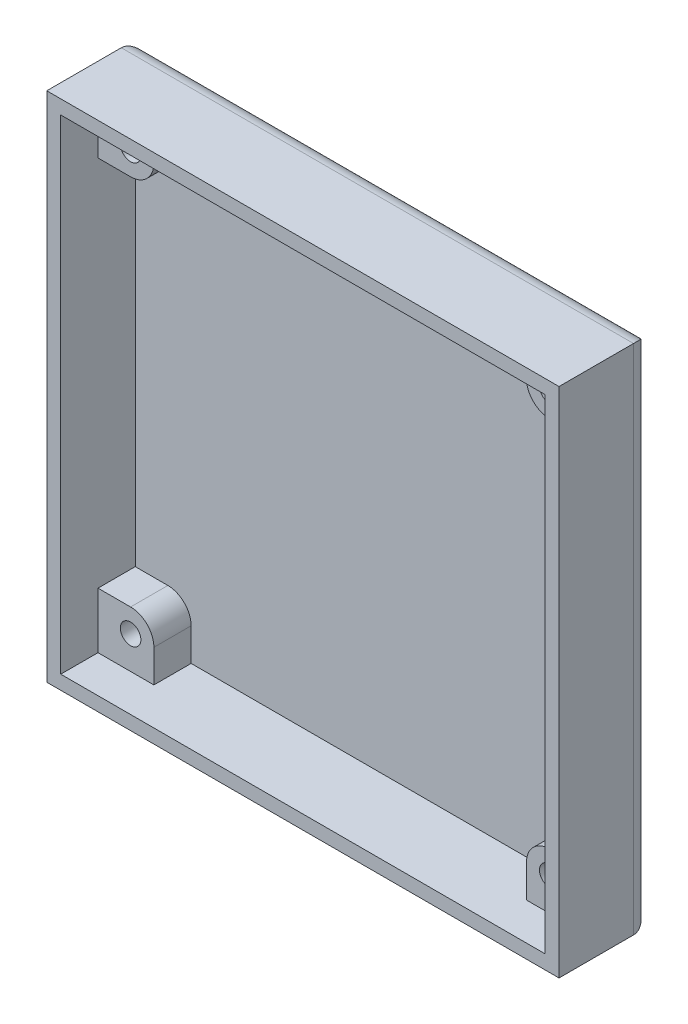
ISO-10303-21;
HEADER;
FILE_DESCRIPTION(('STEP AP214'),'2;1');
FILE_NAME('part.step','',(''),(''),'','','');
FILE_SCHEMA(('AUTOMOTIVE_DESIGN { 1 0 10303 214 1 1 1 1 }'));
ENDSEC;
DATA;
#1=APPLICATION_CONTEXT('core data for automotive mechanical design processes');
#2=APPLICATION_PROTOCOL_DEFINITION('international standard','automotive_design',2000,#1);
#3=PRODUCT_CONTEXT('',#1,'mechanical');
#4=PRODUCT('Part','Part','',(#3));
#5=PRODUCT_RELATED_PRODUCT_CATEGORY('part','',(#4));
#6=PRODUCT_DEFINITION_FORMATION('','',#4);
#7=PRODUCT_DEFINITION_CONTEXT('part definition',#1,'design');
#8=PRODUCT_DEFINITION('design','',#6,#7);
#9=PRODUCT_DEFINITION_SHAPE('','',#8);
#10=(LENGTH_UNIT() NAMED_UNIT(*) SI_UNIT(.MILLI.,.METRE.));
#11=(NAMED_UNIT(*) PLANE_ANGLE_UNIT() SI_UNIT($,.RADIAN.));
#12=(NAMED_UNIT(*) SI_UNIT($,.STERADIAN.) SOLID_ANGLE_UNIT());
#13=UNCERTAINTY_MEASURE_WITH_UNIT(LENGTH_MEASURE(1.E-05),#10,'distance_accuracy_value','');
#14=(GEOMETRIC_REPRESENTATION_CONTEXT(3) GLOBAL_UNCERTAINTY_ASSIGNED_CONTEXT((#13)) GLOBAL_UNIT_ASSIGNED_CONTEXT((#10,
#11,#12)) REPRESENTATION_CONTEXT('',''));
#15=CARTESIAN_POINT('',(0.,0.,0.));
#16=DIRECTION('',(0.,0.,1.));
#17=DIRECTION('',(1.,0.,0.));
#18=AXIS2_PLACEMENT_3D('',#15,#16,#17);
#19=CARTESIAN_POINT('',(22.5,-22.5,6.));
#20=DIRECTION('',(0.,0.,-1.));
#21=DIRECTION('',(-1.,0.,0.));
#22=AXIS2_PLACEMENT_3D('',#19,#20,#21);
#23=CYLINDRICAL_SURFACE('',#22,2.5);
#24=DIRECTION('',(0.,0.,-1.));
#25=VECTOR('',#24,1.);
#26=CARTESIAN_POINT('',(20.,-22.5,6.));
#27=LINE('',#26,#25);
#28=CARTESIAN_POINT('',(20.,-22.5,6.));
#29=VERTEX_POINT('',#28);
#30=CARTESIAN_POINT('',(20.,-22.5,2.));
#31=VERTEX_POINT('',#30);
#32=EDGE_CURVE('E242',#29,#31,#27,.T.);
#33=ORIENTED_EDGE('',*,*,#32,.F.);
#34=CARTESIAN_POINT('',(22.5,-22.5,6.));
#35=DIRECTION('',(0.,0.,1.));
#36=DIRECTION('',(1.,0.,0.));
#37=AXIS2_PLACEMENT_3D('',#34,#35,#36);
#38=CIRCLE('',#37,2.5);
#39=CARTESIAN_POINT('',(22.5,-20.,6.));
#40=VERTEX_POINT('',#39);
#41=EDGE_CURVE('E230',#40,#29,#38,.T.);
#42=ORIENTED_EDGE('',*,*,#41,.F.);
#43=DIRECTION('',(0.,0.,-1.));
#44=VECTOR('',#43,1.);
#45=CARTESIAN_POINT('',(22.5,-20.,6.));
#46=LINE('',#45,#44);
#47=CARTESIAN_POINT('',(22.5,-20.,2.));
#48=VERTEX_POINT('',#47);
#49=EDGE_CURVE('E247',#40,#48,#46,.T.);
#50=ORIENTED_EDGE('',*,*,#49,.T.);
#51=CARTESIAN_POINT('',(22.5,-22.5,2.));
#52=DIRECTION('',(0.,0.,-1.));
#53=DIRECTION('',(-1.,0.,0.));
#54=AXIS2_PLACEMENT_3D('',#51,#52,#53);
#55=CIRCLE('',#54,2.5);
#56=EDGE_CURVE('E11',#48,#31,#55,.F.);
#57=ORIENTED_EDGE('',*,*,#56,.T.);
#58=EDGE_LOOP('',(#33,#42,#50,#57));
#59=FACE_BOUND('',#58,.T.);
#60=ADVANCED_FACE('F39',(#59),#23,.T.);
#61=CARTESIAN_POINT('',(0.,0.,2.));
#62=DIRECTION('',(0.,0.,-1.));
#63=DIRECTION('',(-1.,0.,0.));
#64=AXIS2_PLACEMENT_3D('',#61,#62,#63);
#65=PLANE('',#64);
#66=DIRECTION('',(1.,0.,0.));
#67=VECTOR('',#66,1.);
#68=CARTESIAN_POINT('',(-26.,-26.,2.));
#69=LINE('',#68,#67);
#70=CARTESIAN_POINT('',(-20.,-26.,2.));
#71=VERTEX_POINT('',#70);
#72=CARTESIAN_POINT('',(20.,-26.,2.));
#73=VERTEX_POINT('',#72);
#74=EDGE_CURVE('E365',#71,#73,#69,.T.);
#75=ORIENTED_EDGE('',*,*,#74,.T.);
#76=DIRECTION('',(0.,1.,0.));
#77=VECTOR('',#76,1.);
#78=CARTESIAN_POINT('',(20.,0.,2.));
#79=LINE('',#78,#77);
#80=EDGE_CURVE('E218',#73,#31,#79,.T.);
#81=ORIENTED_EDGE('',*,*,#80,.T.);
#82=ORIENTED_EDGE('',*,*,#56,.F.);
#83=DIRECTION('',(1.,0.,0.));
#84=VECTOR('',#83,1.);
#85=CARTESIAN_POINT('',(0.,-20.,2.));
#86=LINE('',#85,#84);
#87=CARTESIAN_POINT('',(26.,-20.,2.));
#88=VERTEX_POINT('',#87);
#89=EDGE_CURVE('E231',#48,#88,#86,.T.);
#90=ORIENTED_EDGE('',*,*,#89,.T.);
#91=DIRECTION('',(0.,1.,0.));
#92=VECTOR('',#91,1.);
#93=CARTESIAN_POINT('',(26.,-26.,2.));
#94=LINE('',#93,#92);
#95=CARTESIAN_POINT('',(26.,20.,2.));
#96=VERTEX_POINT('',#95);
#97=EDGE_CURVE('E356',#88,#96,#94,.T.);
#98=ORIENTED_EDGE('',*,*,#97,.T.);
#99=DIRECTION('',(-1.,0.,0.));
#100=VECTOR('',#99,1.);
#101=CARTESIAN_POINT('',(0.,20.,2.));
#102=LINE('',#101,#100);
#103=CARTESIAN_POINT('',(22.5,20.,2.));
#104=VERTEX_POINT('',#103);
#105=EDGE_CURVE('E283',#96,#104,#102,.T.);
#106=ORIENTED_EDGE('',*,*,#105,.T.);
#107=CARTESIAN_POINT('',(22.5,22.5,2.));
#108=DIRECTION('',(0.,0.,-1.));
#109=DIRECTION('',(-1.,0.,0.));
#110=AXIS2_PLACEMENT_3D('',#107,#108,#109);
#111=CIRCLE('',#110,2.5);
#112=CARTESIAN_POINT('',(20.,22.5,2.));
#113=VERTEX_POINT('',#112);
#114=EDGE_CURVE('E435',#113,#104,#111,.F.);
#115=ORIENTED_EDGE('',*,*,#114,.F.);
#116=DIRECTION('',(0.,1.,0.));
#117=VECTOR('',#116,1.);
#118=CARTESIAN_POINT('',(20.,0.,2.));
#119=LINE('',#118,#117);
#120=CARTESIAN_POINT('',(20.,26.,2.));
#121=VERTEX_POINT('',#120);
#122=EDGE_CURVE('E287',#113,#121,#119,.T.);
#123=ORIENTED_EDGE('',*,*,#122,.T.);
#124=DIRECTION('',(-1.,0.,0.));
#125=VECTOR('',#124,1.);
#126=CARTESIAN_POINT('',(-26.,26.,2.));
#127=LINE('',#126,#125);
#128=CARTESIAN_POINT('',(-20.,26.,2.));
#129=VERTEX_POINT('',#128);
#130=EDGE_CURVE('E358',#121,#129,#127,.T.);
#131=ORIENTED_EDGE('',*,*,#130,.T.);
#132=DIRECTION('',(0.,1.,0.));
#133=VECTOR('',#132,1.);
#134=CARTESIAN_POINT('',(-20.,0.,2.));
#135=LINE('',#134,#133);
#136=CARTESIAN_POINT('',(-20.,22.5,2.));
#137=VERTEX_POINT('',#136);
#138=EDGE_CURVE('E271',#137,#129,#135,.T.);
#139=ORIENTED_EDGE('',*,*,#138,.F.);
#140=CARTESIAN_POINT('',(-22.5,22.5,2.));
#141=DIRECTION('',(0.,0.,-1.));
#142=DIRECTION('',(-1.,0.,0.));
#143=AXIS2_PLACEMENT_3D('',#140,#141,#142);
#144=CIRCLE('',#143,2.5);
#145=CARTESIAN_POINT('',(-22.5,20.,2.));
#146=VERTEX_POINT('',#145);
#147=EDGE_CURVE('E424',#146,#137,#144,.F.);
#148=ORIENTED_EDGE('',*,*,#147,.F.);
#149=DIRECTION('',(1.,0.,0.));
#150=VECTOR('',#149,1.);
#151=CARTESIAN_POINT('',(0.,20.,2.));
#152=LINE('',#151,#150);
#153=CARTESIAN_POINT('',(-26.,20.,2.));
#154=VERTEX_POINT('',#153);
#155=EDGE_CURVE('E308',#154,#146,#152,.T.);
#156=ORIENTED_EDGE('',*,*,#155,.F.);
#157=DIRECTION('',(0.,-1.,0.));
#158=VECTOR('',#157,1.);
#159=CARTESIAN_POINT('',(-26.,-26.,2.));
#160=LINE('',#159,#158);
#161=CARTESIAN_POINT('',(-26.,-20.,2.));
#162=VERTEX_POINT('',#161);
#163=EDGE_CURVE('E362',#154,#162,#160,.T.);
#164=ORIENTED_EDGE('',*,*,#163,.T.);
#165=DIRECTION('',(-1.,0.,0.));
#166=VECTOR('',#165,1.);
#167=CARTESIAN_POINT('',(0.,-20.,2.));
#168=LINE('',#167,#166);
#169=CARTESIAN_POINT('',(-22.5,-20.,2.));
#170=VERTEX_POINT('',#169);
#171=EDGE_CURVE('E255',#170,#162,#168,.T.);
#172=ORIENTED_EDGE('',*,*,#171,.F.);
#173=CARTESIAN_POINT('',(-22.5,-22.5,2.));
#174=DIRECTION('',(0.,0.,-1.));
#175=DIRECTION('',(-1.,0.,0.));
#176=AXIS2_PLACEMENT_3D('',#173,#174,#175);
#177=CIRCLE('',#176,2.5);
#178=CARTESIAN_POINT('',(-20.,-22.5,2.));
#179=VERTEX_POINT('',#178);
#180=EDGE_CURVE('E47',#179,#170,#177,.F.);
#181=ORIENTED_EDGE('',*,*,#180,.F.);
#182=DIRECTION('',(0.,1.,0.));
#183=VECTOR('',#182,1.);
#184=CARTESIAN_POINT('',(-20.,0.,2.));
#185=LINE('',#184,#183);
#186=EDGE_CURVE('E223',#71,#179,#185,.T.);
#187=ORIENTED_EDGE('',*,*,#186,.F.);
#188=EDGE_LOOP('',(#75,#81,#82,#90,#98,#106,#115,#123,#131,#139,#148,#156,#164,#172,#181,#187));
#189=FACE_BOUND('',#188,.T.);
#190=ADVANCED_FACE('F446',(#189),#65,.F.);
#191=CARTESIAN_POINT('',(-26.,-26.,2.));
#192=DIRECTION('',(-1.,0.,0.));
#193=DIRECTION('',(0.,0.,1.));
#194=AXIS2_PLACEMENT_3D('',#191,#192,#193);
#195=PLANE('',#194);
#196=DIRECTION('',(0.,0.,-1.));
#197=VECTOR('',#196,1.);
#198=CARTESIAN_POINT('',(-26.,-20.,6.));
#199=LINE('',#198,#197);
#200=CARTESIAN_POINT('',(-26.,-20.,6.));
#201=VERTEX_POINT('',#200);
#202=EDGE_CURVE('E261',#201,#162,#199,.T.);
#203=ORIENTED_EDGE('',*,*,#202,.T.);
#204=ORIENTED_EDGE('',*,*,#163,.F.);
#205=DIRECTION('',(0.,0.,-1.));
#206=VECTOR('',#205,1.);
#207=CARTESIAN_POINT('',(-26.,20.,6.));
#208=LINE('',#207,#206);
#209=CARTESIAN_POINT('',(-26.,20.,6.));
#210=VERTEX_POINT('',#209);
#211=EDGE_CURVE('E319',#210,#154,#208,.T.);
#212=ORIENTED_EDGE('',*,*,#211,.F.);
#213=DIRECTION('',(0.,-1.,0.));
#214=VECTOR('',#213,1.);
#215=CARTESIAN_POINT('',(-26.,0.,6.));
#216=LINE('',#215,#214);
#217=CARTESIAN_POINT('',(-26.,26.,6.));
#218=VERTEX_POINT('',#217);
#219=EDGE_CURVE('E309',#218,#210,#216,.T.);
#220=ORIENTED_EDGE('',*,*,#219,.F.);
#221=DIRECTION('',(0.,0.,1.));
#222=VECTOR('',#221,1.);
#223=CARTESIAN_POINT('',(-26.,26.,2.));
#224=LINE('',#223,#222);
#225=CARTESIAN_POINT('',(-26.,26.,10.));
#226=VERTEX_POINT('',#225);
#227=EDGE_CURVE('E383',#218,#226,#224,.T.);
#228=ORIENTED_EDGE('',*,*,#227,.T.);
#229=DIRECTION('',(0.,-1.,0.));
#230=VECTOR('',#229,1.);
#231=CARTESIAN_POINT('',(-26.,-26.,10.));
#232=LINE('',#231,#230);
#233=CARTESIAN_POINT('',(-26.,-26.,10.));
#234=VERTEX_POINT('',#233);
#235=EDGE_CURVE('E375',#226,#234,#232,.T.);
#236=ORIENTED_EDGE('',*,*,#235,.T.);
#237=DIRECTION('',(0.,0.,1.));
#238=VECTOR('',#237,1.);
#239=CARTESIAN_POINT('',(-26.,-26.,2.));
#240=LINE('',#239,#238);
#241=CARTESIAN_POINT('',(-26.,-26.,6.));
#242=VERTEX_POINT('',#241);
#243=EDGE_CURVE('E381',#242,#234,#240,.T.);
#244=ORIENTED_EDGE('',*,*,#243,.F.);
#245=DIRECTION('',(0.,-1.,0.));
#246=VECTOR('',#245,1.);
#247=CARTESIAN_POINT('',(-26.,0.,6.));
#248=LINE('',#247,#246);
#249=EDGE_CURVE('E259',#201,#242,#248,.T.);
#250=ORIENTED_EDGE('',*,*,#249,.F.);
#251=EDGE_LOOP('',(#203,#204,#212,#220,#228,#236,#244,#250));
#252=FACE_BOUND('',#251,.T.);
#253=ADVANCED_FACE('F454',(#252),#195,.F.);
#254=CARTESIAN_POINT('',(-26.,-26.,2.));
#255=DIRECTION('',(0.,-1.,0.));
#256=DIRECTION('',(0.,0.,-1.));
#257=AXIS2_PLACEMENT_3D('',#254,#255,#256);
#258=PLANE('',#257);
#259=DIRECTION('',(1.,0.,0.));
#260=VECTOR('',#259,1.);
#261=CARTESIAN_POINT('',(0.,-26.,6.));
#262=LINE('',#261,#260);
#263=CARTESIAN_POINT('',(20.,-26.,6.));
#264=VERTEX_POINT('',#263);
#265=CARTESIAN_POINT('',(26.,-26.,6.));
#266=VERTEX_POINT('',#265);
#267=EDGE_CURVE('E227',#264,#266,#262,.T.);
#268=ORIENTED_EDGE('',*,*,#267,.F.);
#269=DIRECTION('',(0.,0.,-1.));
#270=VECTOR('',#269,1.);
#271=CARTESIAN_POINT('',(20.,-26.,6.));
#272=LINE('',#271,#270);
#273=EDGE_CURVE('E212',#264,#73,#272,.T.);
#274=ORIENTED_EDGE('',*,*,#273,.T.);
#275=ORIENTED_EDGE('',*,*,#74,.F.);
#276=DIRECTION('',(0.,0.,-1.));
#277=VECTOR('',#276,1.);
#278=CARTESIAN_POINT('',(-20.,-26.,6.));
#279=LINE('',#278,#277);
#280=CARTESIAN_POINT('',(-20.,-26.,6.));
#281=VERTEX_POINT('',#280);
#282=EDGE_CURVE('E269',#281,#71,#279,.T.);
#283=ORIENTED_EDGE('',*,*,#282,.F.);
#284=DIRECTION('',(1.,0.,0.));
#285=VECTOR('',#284,1.);
#286=CARTESIAN_POINT('',(0.,-26.,6.));
#287=LINE('',#286,#285);
#288=EDGE_CURVE('E251',#242,#281,#287,.T.);
#289=ORIENTED_EDGE('',*,*,#288,.F.);
#290=ORIENTED_EDGE('',*,*,#243,.T.);
#291=DIRECTION('',(1.,0.,0.));
#292=VECTOR('',#291,1.);
#293=CARTESIAN_POINT('',(-26.,-26.,10.));
#294=LINE('',#293,#292);
#295=CARTESIAN_POINT('',(26.,-26.,10.));
#296=VERTEX_POINT('',#295);
#297=EDGE_CURVE('E359',#234,#296,#294,.T.);
#298=ORIENTED_EDGE('',*,*,#297,.T.);
#299=DIRECTION('',(0.,0.,1.));
#300=VECTOR('',#299,1.);
#301=CARTESIAN_POINT('',(26.,-26.,2.));
#302=LINE('',#301,#300);
#303=EDGE_CURVE('E236',#266,#296,#302,.T.);
#304=ORIENTED_EDGE('',*,*,#303,.F.);
#305=EDGE_LOOP('',(#268,#274,#275,#283,#289,#290,#298,#304));
#306=FACE_BOUND('',#305,.T.);
#307=ADVANCED_FACE('F234',(#306),#258,.F.);
#308=CARTESIAN_POINT('',(-26.,26.,2.));
#309=DIRECTION('',(0.,1.,0.));
#310=DIRECTION('',(0.,0.,1.));
#311=AXIS2_PLACEMENT_3D('',#308,#309,#310);
#312=PLANE('',#311);
#313=DIRECTION('',(0.,0.,-1.));
#314=VECTOR('',#313,1.);
#315=CARTESIAN_POINT('',(-20.,26.,6.));
#316=LINE('',#315,#314);
#317=CARTESIAN_POINT('',(-20.,26.,6.));
#318=VERTEX_POINT('',#317);
#319=EDGE_CURVE('E277',#318,#129,#316,.T.);
#320=ORIENTED_EDGE('',*,*,#319,.T.);
#321=ORIENTED_EDGE('',*,*,#130,.F.);
#322=DIRECTION('',(0.,0.,-1.));
#323=VECTOR('',#322,1.);
#324=CARTESIAN_POINT('',(20.,26.,6.));
#325=LINE('',#324,#323);
#326=CARTESIAN_POINT('',(20.,26.,6.));
#327=VERTEX_POINT('',#326);
#328=EDGE_CURVE('E303',#327,#121,#325,.T.);
#329=ORIENTED_EDGE('',*,*,#328,.F.);
#330=DIRECTION('',(-1.,0.,0.));
#331=VECTOR('',#330,1.);
#332=CARTESIAN_POINT('',(0.,26.,6.));
#333=LINE('',#332,#331);
#334=CARTESIAN_POINT('',(26.,26.,6.));
#335=VERTEX_POINT('',#334);
#336=EDGE_CURVE('E289',#335,#327,#333,.T.);
#337=ORIENTED_EDGE('',*,*,#336,.F.);
#338=DIRECTION('',(0.,0.,1.));
#339=VECTOR('',#338,1.);
#340=CARTESIAN_POINT('',(26.,26.,2.));
#341=LINE('',#340,#339);
#342=CARTESIAN_POINT('',(26.,26.,10.));
#343=VERTEX_POINT('',#342);
#344=EDGE_CURVE('E367',#335,#343,#341,.T.);
#345=ORIENTED_EDGE('',*,*,#344,.T.);
#346=DIRECTION('',(-1.,0.,0.));
#347=VECTOR('',#346,1.);
#348=CARTESIAN_POINT('',(-26.,26.,10.));
#349=LINE('',#348,#347);
#350=EDGE_CURVE('E371',#343,#226,#349,.T.);
#351=ORIENTED_EDGE('',*,*,#350,.T.);
#352=ORIENTED_EDGE('',*,*,#227,.F.);
#353=DIRECTION('',(-1.,0.,0.));
#354=VECTOR('',#353,1.);
#355=CARTESIAN_POINT('',(0.,26.,6.));
#356=LINE('',#355,#354);
#357=EDGE_CURVE('E274',#318,#218,#356,.T.);
#358=ORIENTED_EDGE('',*,*,#357,.F.);
#359=EDGE_LOOP('',(#320,#321,#329,#337,#345,#351,#352,#358));
#360=FACE_BOUND('',#359,.T.);
#361=ADVANCED_FACE('F504',(#360),#312,.F.);
#362=CARTESIAN_POINT('',(-22.5,22.5,6.));
#363=DIRECTION('',(0.,0.,-1.));
#364=DIRECTION('',(-1.,0.,0.));
#365=AXIS2_PLACEMENT_3D('',#362,#363,#364);
#366=CYLINDRICAL_SURFACE('',#365,2.5);
#367=DIRECTION('',(0.,0.,-1.));
#368=VECTOR('',#367,1.);
#369=CARTESIAN_POINT('',(-20.,22.5,6.));
#370=LINE('',#369,#368);
#371=CARTESIAN_POINT('',(-20.,22.5,6.));
#372=VERTEX_POINT('',#371);
#373=EDGE_CURVE('E281',#372,#137,#370,.T.);
#374=ORIENTED_EDGE('',*,*,#373,.F.);
#375=CARTESIAN_POINT('',(-22.5,22.5,6.));
#376=DIRECTION('',(0.,0.,1.));
#377=DIRECTION('',(1.,0.,0.));
#378=AXIS2_PLACEMENT_3D('',#375,#376,#377);
#379=CIRCLE('',#378,2.5);
#380=CARTESIAN_POINT('',(-22.5,20.,6.));
#381=VERTEX_POINT('',#380);
#382=EDGE_CURVE('E352',#381,#372,#379,.T.);
#383=ORIENTED_EDGE('',*,*,#382,.F.);
#384=DIRECTION('',(0.,0.,-1.));
#385=VECTOR('',#384,1.);
#386=CARTESIAN_POINT('',(-22.5,20.,6.));
#387=LINE('',#386,#385);
#388=EDGE_CURVE('E315',#381,#146,#387,.T.);
#389=ORIENTED_EDGE('',*,*,#388,.T.);
#390=ORIENTED_EDGE('',*,*,#147,.T.);
#391=EDGE_LOOP('',(#374,#383,#389,#390));
#392=FACE_BOUND('',#391,.T.);
#393=ADVANCED_FACE('F497',(#392),#366,.T.);
#394=CARTESIAN_POINT('',(22.5,22.5,6.));
#395=DIRECTION('',(0.,0.,-1.));
#396=DIRECTION('',(-1.,0.,0.));
#397=AXIS2_PLACEMENT_3D('',#394,#395,#396);
#398=CYLINDRICAL_SURFACE('',#397,2.5);
#399=DIRECTION('',(0.,0.,-1.));
#400=VECTOR('',#399,1.);
#401=CARTESIAN_POINT('',(22.5,20.,6.));
#402=LINE('',#401,#400);
#403=CARTESIAN_POINT('',(22.5,20.,6.));
#404=VERTEX_POINT('',#403);
#405=EDGE_CURVE('E294',#404,#104,#402,.T.);
#406=ORIENTED_EDGE('',*,*,#405,.F.);
#407=CARTESIAN_POINT('',(22.5,22.5,6.));
#408=DIRECTION('',(0.,0.,1.));
#409=DIRECTION('',(1.,0.,0.));
#410=AXIS2_PLACEMENT_3D('',#407,#408,#409);
#411=CIRCLE('',#410,2.5);
#412=CARTESIAN_POINT('',(20.,22.5,6.));
#413=VERTEX_POINT('',#412);
#414=EDGE_CURVE('E349',#413,#404,#411,.T.);
#415=ORIENTED_EDGE('',*,*,#414,.F.);
#416=DIRECTION('',(0.,0.,-1.));
#417=VECTOR('',#416,1.);
#418=CARTESIAN_POINT('',(20.,22.5,6.));
#419=LINE('',#418,#417);
#420=EDGE_CURVE('E300',#413,#113,#419,.T.);
#421=ORIENTED_EDGE('',*,*,#420,.T.);
#422=ORIENTED_EDGE('',*,*,#114,.T.);
#423=EDGE_LOOP('',(#406,#415,#421,#422));
#424=FACE_BOUND('',#423,.T.);
#425=ADVANCED_FACE('F493',(#424),#398,.T.);
#426=CARTESIAN_POINT('',(27.5,-27.5,10.));
#427=DIRECTION('',(-1.,0.,0.));
#428=DIRECTION('',(0.,0.,1.));
#429=AXIS2_PLACEMENT_3D('',#426,#427,#428);
#430=PLANE('',#429);
#431=DIRECTION('',(0.,0.,-1.));
#432=VECTOR('',#431,1.);
#433=CARTESIAN_POINT('',(27.5,-27.5,10.));
#434=LINE('',#433,#432);
#435=CARTESIAN_POINT('',(27.5,-27.5,10.));
#436=VERTEX_POINT('',#435);
#437=CARTESIAN_POINT('',(27.5,-27.5,2.));
#438=VERTEX_POINT('',#437);
#439=EDGE_CURVE('E394',#436,#438,#434,.T.);
#440=ORIENTED_EDGE('',*,*,#439,.T.);
#441=DIRECTION('',(0.,1.,0.));
#442=VECTOR('',#441,1.);
#443=CARTESIAN_POINT('',(27.5,27.5,2.));
#444=LINE('',#443,#442);
#445=CARTESIAN_POINT('',(27.5,27.5,2.));
#446=VERTEX_POINT('',#445);
#447=EDGE_CURVE('E406',#438,#446,#444,.T.);
#448=ORIENTED_EDGE('',*,*,#447,.T.);
#449=DIRECTION('',(0.,0.,-1.));
#450=VECTOR('',#449,1.);
#451=CARTESIAN_POINT('',(27.5,27.5,10.));
#452=LINE('',#451,#450);
#453=CARTESIAN_POINT('',(27.5,27.5,10.));
#454=VERTEX_POINT('',#453);
#455=EDGE_CURVE('E403',#454,#446,#452,.T.);
#456=ORIENTED_EDGE('',*,*,#455,.F.);
#457=DIRECTION('',(0.,1.,0.));
#458=VECTOR('',#457,1.);
#459=CARTESIAN_POINT('',(27.5,-27.5,10.));
#460=LINE('',#459,#458);
#461=EDGE_CURVE('E380',#436,#454,#460,.T.);
#462=ORIENTED_EDGE('',*,*,#461,.F.);
#463=EDGE_LOOP('',(#440,#448,#456,#462));
#464=FACE_BOUND('',#463,.T.);
#465=ADVANCED_FACE('F496',(#464),#430,.F.);
#466=CARTESIAN_POINT('',(-27.5,27.5,10.));
#467=DIRECTION('',(0.,-1.,0.));
#468=DIRECTION('',(0.,0.,-1.));
#469=AXIS2_PLACEMENT_3D('',#466,#467,#468);
#470=PLANE('',#469);
#471=ORIENTED_EDGE('',*,*,#455,.T.);
#472=DIRECTION('',(-1.,0.,0.));
#473=VECTOR('',#472,1.);
#474=CARTESIAN_POINT('',(-27.5,27.5,2.));
#475=LINE('',#474,#473);
#476=CARTESIAN_POINT('',(-27.5,27.5,2.));
#477=VERTEX_POINT('',#476);
#478=EDGE_CURVE('E422',#446,#477,#475,.T.);
#479=ORIENTED_EDGE('',*,*,#478,.T.);
#480=DIRECTION('',(0.,0.,-1.));
#481=VECTOR('',#480,1.);
#482=CARTESIAN_POINT('',(-27.5,27.5,10.));
#483=LINE('',#482,#481);
#484=CARTESIAN_POINT('',(-27.5,27.5,10.));
#485=VERTEX_POINT('',#484);
#486=EDGE_CURVE('E400',#485,#477,#483,.T.);
#487=ORIENTED_EDGE('',*,*,#486,.F.);
#488=DIRECTION('',(-1.,0.,0.));
#489=VECTOR('',#488,1.);
#490=CARTESIAN_POINT('',(-27.5,27.5,10.));
#491=LINE('',#490,#489);
#492=EDGE_CURVE('E388',#454,#485,#491,.T.);
#493=ORIENTED_EDGE('',*,*,#492,.F.);
#494=EDGE_LOOP('',(#471,#479,#487,#493));
#495=FACE_BOUND('',#494,.T.);
#496=ADVANCED_FACE('F533',(#495),#470,.F.);
#497=CARTESIAN_POINT('',(-27.5,-27.5,10.));
#498=DIRECTION('',(1.,0.,0.));
#499=DIRECTION('',(0.,0.,-1.));
#500=AXIS2_PLACEMENT_3D('',#497,#498,#499);
#501=PLANE('',#500);
#502=ORIENTED_EDGE('',*,*,#486,.T.);
#503=DIRECTION('',(0.,-1.,0.));
#504=VECTOR('',#503,1.);
#505=CARTESIAN_POINT('',(-27.5,-27.5,2.));
#506=LINE('',#505,#504);
#507=CARTESIAN_POINT('',(-27.5,-27.5,2.));
#508=VERTEX_POINT('',#507);
#509=EDGE_CURVE('E420',#477,#508,#506,.T.);
#510=ORIENTED_EDGE('',*,*,#509,.T.);
#511=DIRECTION('',(0.,0.,-1.));
#512=VECTOR('',#511,1.);
#513=CARTESIAN_POINT('',(-27.5,-27.5,10.));
#514=LINE('',#513,#512);
#515=CARTESIAN_POINT('',(-27.5,-27.5,10.));
#516=VERTEX_POINT('',#515);
#517=EDGE_CURVE('E397',#516,#508,#514,.T.);
#518=ORIENTED_EDGE('',*,*,#517,.F.);
#519=DIRECTION('',(0.,-1.,0.));
#520=VECTOR('',#519,1.);
#521=CARTESIAN_POINT('',(-27.5,-27.5,10.));
#522=LINE('',#521,#520);
#523=EDGE_CURVE('E390',#485,#516,#522,.T.);
#524=ORIENTED_EDGE('',*,*,#523,.F.);
#525=EDGE_LOOP('',(#502,#510,#518,#524));
#526=FACE_BOUND('',#525,.T.);
#527=ADVANCED_FACE('F529',(#526),#501,.F.);
#528=CARTESIAN_POINT('',(-27.5,-27.5,10.));
#529=DIRECTION('',(0.,1.,0.));
#530=DIRECTION('',(0.,0.,1.));
#531=AXIS2_PLACEMENT_3D('',#528,#529,#530);
#532=PLANE('',#531);
#533=ORIENTED_EDGE('',*,*,#517,.T.);
#534=DIRECTION('',(1.,0.,0.));
#535=VECTOR('',#534,1.);
#536=CARTESIAN_POINT('',(27.5,-27.5,2.));
#537=LINE('',#536,#535);
#538=EDGE_CURVE('E418',#508,#438,#537,.T.);
#539=ORIENTED_EDGE('',*,*,#538,.T.);
#540=ORIENTED_EDGE('',*,*,#439,.F.);
#541=DIRECTION('',(1.,0.,0.));
#542=VECTOR('',#541,1.);
#543=CARTESIAN_POINT('',(-27.5,-27.5,10.));
#544=LINE('',#543,#542);
#545=EDGE_CURVE('E392',#516,#436,#544,.T.);
#546=ORIENTED_EDGE('',*,*,#545,.F.);
#547=EDGE_LOOP('',(#533,#539,#540,#546));
#548=FACE_BOUND('',#547,.T.);
#549=ADVANCED_FACE('F522',(#548),#532,.F.);
#550=CARTESIAN_POINT('',(0.,0.,10.));
#551=DIRECTION('',(0.,0.,-1.));
#552=DIRECTION('',(-1.,0.,0.));
#553=AXIS2_PLACEMENT_3D('',#550,#551,#552);
#554=PLANE('',#553);
#555=ORIENTED_EDGE('',*,*,#350,.F.);
#556=DIRECTION('',(0.,1.,0.));
#557=VECTOR('',#556,1.);
#558=CARTESIAN_POINT('',(26.,-26.,10.));
#559=LINE('',#558,#557);
#560=EDGE_CURVE('E368',#296,#343,#559,.T.);
#561=ORIENTED_EDGE('',*,*,#560,.F.);
#562=ORIENTED_EDGE('',*,*,#297,.F.);
#563=ORIENTED_EDGE('',*,*,#235,.F.);
#564=EDGE_LOOP('',(#555,#561,#562,#563));
#565=FACE_BOUND('',#564,.T.);
#566=ORIENTED_EDGE('',*,*,#461,.T.);
#567=ORIENTED_EDGE('',*,*,#492,.T.);
#568=ORIENTED_EDGE('',*,*,#523,.T.);
#569=ORIENTED_EDGE('',*,*,#545,.T.);
#570=EDGE_LOOP('',(#566,#567,#568,#569));
#571=FACE_BOUND('',#570,.T.);
#572=ADVANCED_FACE('F519',(#565,#571),#554,.F.);
#573=CARTESIAN_POINT('',(0.,0.,0.));
#574=DIRECTION('',(0.,0.,-1.));
#575=DIRECTION('',(-1.,0.,0.));
#576=AXIS2_PLACEMENT_3D('',#573,#574,#575);
#577=PLANE('',#576);
#578=DIRECTION('',(-1.,0.,0.));
#579=VECTOR('',#578,1.);
#580=CARTESIAN_POINT('',(27.5,25.5,0.));
#581=LINE('',#580,#579);
#582=CARTESIAN_POINT('',(-25.5,25.5,0.));
#583=VERTEX_POINT('',#582);
#584=CARTESIAN_POINT('',(25.5,25.5,0.));
#585=VERTEX_POINT('',#584);
#586=EDGE_CURVE('E409',#583,#585,#581,.F.);
#587=ORIENTED_EDGE('',*,*,#586,.T.);
#588=DIRECTION('',(0.,1.,0.));
#589=VECTOR('',#588,1.);
#590=CARTESIAN_POINT('',(25.5,-27.5,0.));
#591=LINE('',#590,#589);
#592=CARTESIAN_POINT('',(25.5,-25.5,0.));
#593=VERTEX_POINT('',#592);
#594=EDGE_CURVE('E415',#585,#593,#591,.F.);
#595=ORIENTED_EDGE('',*,*,#594,.T.);
#596=DIRECTION('',(1.,0.,0.));
#597=VECTOR('',#596,1.);
#598=CARTESIAN_POINT('',(-27.5,-25.5,0.));
#599=LINE('',#598,#597);
#600=CARTESIAN_POINT('',(-25.5,-25.5,0.));
#601=VERTEX_POINT('',#600);
#602=EDGE_CURVE('E413',#593,#601,#599,.F.);
#603=ORIENTED_EDGE('',*,*,#602,.T.);
#604=DIRECTION('',(0.,-1.,0.));
#605=VECTOR('',#604,1.);
#606=CARTESIAN_POINT('',(-25.5,27.5,0.));
#607=LINE('',#606,#605);
#608=EDGE_CURVE('E411',#601,#583,#607,.F.);
#609=ORIENTED_EDGE('',*,*,#608,.T.);
#610=EDGE_LOOP('',(#587,#595,#603,#609));
#611=FACE_BOUND('',#610,.T.);
#612=ADVANCED_FACE('F517',(#611),#577,.T.);
#613=CARTESIAN_POINT('',(26.,-26.,2.));
#614=DIRECTION('',(1.,0.,0.));
#615=DIRECTION('',(0.,0.,-1.));
#616=AXIS2_PLACEMENT_3D('',#613,#614,#615);
#617=PLANE('',#616);
#618=ORIENTED_EDGE('',*,*,#97,.F.);
#619=DIRECTION('',(0.,0.,-1.));
#620=VECTOR('',#619,1.);
#621=CARTESIAN_POINT('',(26.,-20.,6.));
#622=LINE('',#621,#620);
#623=CARTESIAN_POINT('',(26.,-20.,6.));
#624=VERTEX_POINT('',#623);
#625=EDGE_CURVE('E224',#624,#88,#622,.T.);
#626=ORIENTED_EDGE('',*,*,#625,.F.);
#627=DIRECTION('',(0.,1.,0.));
#628=VECTOR('',#627,1.);
#629=CARTESIAN_POINT('',(26.,0.,6.));
#630=LINE('',#629,#628);
#631=EDGE_CURVE('E237',#266,#624,#630,.T.);
#632=ORIENTED_EDGE('',*,*,#631,.F.);
#633=ORIENTED_EDGE('',*,*,#303,.T.);
#634=ORIENTED_EDGE('',*,*,#560,.T.);
#635=ORIENTED_EDGE('',*,*,#344,.F.);
#636=DIRECTION('',(0.,1.,0.));
#637=VECTOR('',#636,1.);
#638=CARTESIAN_POINT('',(26.,0.,6.));
#639=LINE('',#638,#637);
#640=CARTESIAN_POINT('',(26.,20.,6.));
#641=VERTEX_POINT('',#640);
#642=EDGE_CURVE('E286',#641,#335,#639,.T.);
#643=ORIENTED_EDGE('',*,*,#642,.F.);
#644=DIRECTION('',(0.,0.,-1.));
#645=VECTOR('',#644,1.);
#646=CARTESIAN_POINT('',(26.,20.,6.));
#647=LINE('',#646,#645);
#648=EDGE_CURVE('E305',#641,#96,#647,.T.);
#649=ORIENTED_EDGE('',*,*,#648,.T.);
#650=EDGE_LOOP('',(#618,#626,#632,#633,#634,#635,#643,#649));
#651=FACE_BOUND('',#650,.T.);
#652=ADVANCED_FACE('F514',(#651),#617,.F.);
#653=CARTESIAN_POINT('',(-25.5,-27.5,2.));
#654=DIRECTION('',(0.,1.,0.));
#655=DIRECTION('',(0.,0.,1.));
#656=AXIS2_PLACEMENT_3D('',#653,#654,#655);
#657=CYLINDRICAL_SURFACE('',#656,2.);
#658=CARTESIAN_POINT('',(-25.5,25.5,2.));
#659=DIRECTION('',(0.707106781186547,0.707106781186547,0.));
#660=DIRECTION('',(0.707106781186547,-0.707106781186547,0.));
#661=AXIS2_PLACEMENT_3D('',#658,#659,#660);
#662=ELLIPSE('',#661,2.82842712474619,2.);
#663=EDGE_CURVE('E428',#583,#477,#662,.T.);
#664=ORIENTED_EDGE('',*,*,#663,.F.);
#665=ORIENTED_EDGE('',*,*,#608,.F.);
#666=CARTESIAN_POINT('',(-25.5,-25.5,2.));
#667=DIRECTION('',(-0.707106781186547,0.707106781186547,0.));
#668=DIRECTION('',(0.707106781186547,0.707106781186547,0.));
#669=AXIS2_PLACEMENT_3D('',#666,#667,#668);
#670=ELLIPSE('',#669,2.82842712474619,2.);
#671=EDGE_CURVE('E372',#508,#601,#670,.F.);
#672=ORIENTED_EDGE('',*,*,#671,.F.);
#673=ORIENTED_EDGE('',*,*,#509,.F.);
#674=EDGE_LOOP('',(#664,#665,#672,#673));
#675=FACE_BOUND('',#674,.T.);
#676=ADVANCED_FACE('F41',(#675),#657,.T.);
#677=CARTESIAN_POINT('',(-27.5,-25.5,2.));
#678=DIRECTION('',(-1.,0.,0.));
#679=DIRECTION('',(0.,0.,1.));
#680=AXIS2_PLACEMENT_3D('',#677,#678,#679);
#681=CYLINDRICAL_SURFACE('',#680,2.);
#682=ORIENTED_EDGE('',*,*,#671,.T.);
#683=ORIENTED_EDGE('',*,*,#602,.F.);
#684=CARTESIAN_POINT('',(25.5,-25.5,2.));
#685=DIRECTION('',(-0.707106781186547,-0.707106781186547,0.));
#686=DIRECTION('',(-0.707106781186547,0.707106781186547,0.));
#687=AXIS2_PLACEMENT_3D('',#684,#685,#686);
#688=ELLIPSE('',#687,2.82842712474619,2.);
#689=EDGE_CURVE('E426',#438,#593,#688,.F.);
#690=ORIENTED_EDGE('',*,*,#689,.F.);
#691=ORIENTED_EDGE('',*,*,#538,.F.);
#692=EDGE_LOOP('',(#682,#683,#690,#691));
#693=FACE_BOUND('',#692,.T.);
#694=ADVANCED_FACE('F546',(#693),#681,.T.);
#695=CARTESIAN_POINT('',(-27.5,25.5,2.));
#696=DIRECTION('',(1.,0.,0.));
#697=DIRECTION('',(0.,0.,-1.));
#698=AXIS2_PLACEMENT_3D('',#695,#696,#697);
#699=CYLINDRICAL_SURFACE('',#698,2.);
#700=ORIENTED_EDGE('',*,*,#663,.T.);
#701=ORIENTED_EDGE('',*,*,#478,.F.);
#702=CARTESIAN_POINT('',(25.5,25.5,2.));
#703=DIRECTION('',(0.707106781186547,-0.707106781186547,0.));
#704=DIRECTION('',(0.707106781186547,0.707106781186547,0.));
#705=AXIS2_PLACEMENT_3D('',#702,#703,#704);
#706=ELLIPSE('',#705,2.82842712474619,2.);
#707=EDGE_CURVE('E355',#585,#446,#706,.T.);
#708=ORIENTED_EDGE('',*,*,#707,.F.);
#709=ORIENTED_EDGE('',*,*,#586,.F.);
#710=EDGE_LOOP('',(#700,#701,#708,#709));
#711=FACE_BOUND('',#710,.T.);
#712=ADVANCED_FACE('F543',(#711),#699,.T.);
#713=CARTESIAN_POINT('',(25.5,-27.5,2.));
#714=DIRECTION('',(0.,-1.,0.));
#715=DIRECTION('',(0.,0.,-1.));
#716=AXIS2_PLACEMENT_3D('',#713,#714,#715);
#717=CYLINDRICAL_SURFACE('',#716,2.);
#718=ORIENTED_EDGE('',*,*,#689,.T.);
#719=ORIENTED_EDGE('',*,*,#594,.F.);
#720=ORIENTED_EDGE('',*,*,#707,.T.);
#721=ORIENTED_EDGE('',*,*,#447,.F.);
#722=EDGE_LOOP('',(#718,#719,#720,#721));
#723=FACE_BOUND('',#722,.T.);
#724=ADVANCED_FACE('F501',(#723),#717,.T.);
#725=CARTESIAN_POINT('',(-22.5,22.5,6.));
#726=DIRECTION('',(0.,0.,1.));
#727=DIRECTION('',(1.,0.,0.));
#728=AXIS2_PLACEMENT_3D('',#725,#726,#727);
#729=PLANE('',#728);
#730=ORIENTED_EDGE('',*,*,#382,.T.);
#731=DIRECTION('',(0.,1.,0.));
#732=VECTOR('',#731,1.);
#733=CARTESIAN_POINT('',(-20.,0.,6.));
#734=LINE('',#733,#732);
#735=EDGE_CURVE('E272',#372,#318,#734,.T.);
#736=ORIENTED_EDGE('',*,*,#735,.T.);
#737=ORIENTED_EDGE('',*,*,#357,.T.);
#738=ORIENTED_EDGE('',*,*,#219,.T.);
#739=DIRECTION('',(1.,0.,0.));
#740=VECTOR('',#739,1.);
#741=CARTESIAN_POINT('',(0.,20.,6.));
#742=LINE('',#741,#740);
#743=EDGE_CURVE('E312',#210,#381,#742,.T.);
#744=ORIENTED_EDGE('',*,*,#743,.T.);
#745=EDGE_LOOP('',(#730,#736,#737,#738,#744));
#746=FACE_BOUND('',#745,.T.);
#747=CARTESIAN_POINT('',(-22.5,22.5,6.));
#748=DIRECTION('',(0.,0.,1.));
#749=DIRECTION('',(1.,0.,0.));
#750=AXIS2_PLACEMENT_3D('',#747,#748,#749);
#751=CIRCLE('',#750,1.1);
#752=CARTESIAN_POINT('',(-21.4,22.5,6.));
#753=VERTEX_POINT('',#752);
#754=EDGE_CURVE('E325',#753,#753,#751,.T.);
#755=ORIENTED_EDGE('',*,*,#754,.F.);
#756=EDGE_LOOP('',(#755));
#757=FACE_BOUND('',#756,.T.);
#758=ADVANCED_FACE('F491',(#746,#757),#729,.T.);
#759=CARTESIAN_POINT('',(22.5,22.5,6.));
#760=DIRECTION('',(0.,0.,1.));
#761=DIRECTION('',(1.,0.,0.));
#762=AXIS2_PLACEMENT_3D('',#759,#760,#761);
#763=PLANE('',#762);
#764=CARTESIAN_POINT('',(22.5,22.5,6.));
#765=DIRECTION('',(0.,0.,1.));
#766=DIRECTION('',(1.,0.,0.));
#767=AXIS2_PLACEMENT_3D('',#764,#765,#766);
#768=CIRCLE('',#767,1.1);
#769=CARTESIAN_POINT('',(23.6,22.5,6.));
#770=VERTEX_POINT('',#769);
#771=EDGE_CURVE('E321',#770,#770,#768,.T.);
#772=ORIENTED_EDGE('',*,*,#771,.F.);
#773=EDGE_LOOP('',(#772));
#774=FACE_BOUND('',#773,.T.);
#775=ORIENTED_EDGE('',*,*,#414,.T.);
#776=DIRECTION('',(-1.,0.,0.));
#777=VECTOR('',#776,1.);
#778=CARTESIAN_POINT('',(0.,20.,6.));
#779=LINE('',#778,#777);
#780=EDGE_CURVE('E284',#641,#404,#779,.T.);
#781=ORIENTED_EDGE('',*,*,#780,.F.);
#782=ORIENTED_EDGE('',*,*,#642,.T.);
#783=ORIENTED_EDGE('',*,*,#336,.T.);
#784=DIRECTION('',(0.,1.,0.));
#785=VECTOR('',#784,1.);
#786=CARTESIAN_POINT('',(20.,0.,6.));
#787=LINE('',#786,#785);
#788=EDGE_CURVE('E291',#413,#327,#787,.T.);
#789=ORIENTED_EDGE('',*,*,#788,.F.);
#790=EDGE_LOOP('',(#775,#781,#782,#783,#789));
#791=FACE_BOUND('',#790,.T.);
#792=ADVANCED_FACE('F488',(#774,#791),#763,.T.);
#793=CARTESIAN_POINT('',(-22.5,-22.5,6.));
#794=DIRECTION('',(0.,0.,-1.));
#795=DIRECTION('',(-1.,0.,0.));
#796=AXIS2_PLACEMENT_3D('',#793,#794,#795);
#797=CYLINDRICAL_SURFACE('',#796,2.5);
#798=CARTESIAN_POINT('',(-22.5,-22.5,6.));
#799=DIRECTION('',(0.,0.,1.));
#800=DIRECTION('',(1.,0.,0.));
#801=AXIS2_PLACEMENT_3D('',#798,#799,#800);
#802=CIRCLE('',#801,2.5);
#803=CARTESIAN_POINT('',(-20.,-22.5,6.));
#804=VERTEX_POINT('',#803);
#805=CARTESIAN_POINT('',(-22.5,-20.,6.));
#806=VERTEX_POINT('',#805);
#807=EDGE_CURVE('E346',#804,#806,#802,.T.);
#808=ORIENTED_EDGE('',*,*,#807,.F.);
#809=DIRECTION('',(0.,0.,-1.));
#810=VECTOR('',#809,1.);
#811=CARTESIAN_POINT('',(-20.,-22.5,6.));
#812=LINE('',#811,#810);
#813=EDGE_CURVE('E62',#804,#179,#812,.T.);
#814=ORIENTED_EDGE('',*,*,#813,.T.);
#815=ORIENTED_EDGE('',*,*,#180,.T.);
#816=DIRECTION('',(0.,0.,-1.));
#817=VECTOR('',#816,1.);
#818=CARTESIAN_POINT('',(-22.5,-20.,6.));
#819=LINE('',#818,#817);
#820=EDGE_CURVE('E266',#806,#170,#819,.T.);
#821=ORIENTED_EDGE('',*,*,#820,.F.);
#822=EDGE_LOOP('',(#808,#814,#815,#821));
#823=FACE_BOUND('',#822,.T.);
#824=ADVANCED_FACE('F442',(#823),#797,.T.);
#825=CARTESIAN_POINT('',(-22.5,-22.5,6.));
#826=DIRECTION('',(0.,0.,1.));
#827=DIRECTION('',(1.,0.,0.));
#828=AXIS2_PLACEMENT_3D('',#825,#826,#827);
#829=PLANE('',#828);
#830=CARTESIAN_POINT('',(-22.5,-22.5,6.));
#831=DIRECTION('',(0.,0.,1.));
#832=DIRECTION('',(1.,0.,0.));
#833=AXIS2_PLACEMENT_3D('',#830,#831,#832);
#834=CIRCLE('',#833,1.1);
#835=CARTESIAN_POINT('',(-21.4,-22.5,6.));
#836=VERTEX_POINT('',#835);
#837=EDGE_CURVE('E331',#836,#836,#834,.T.);
#838=ORIENTED_EDGE('',*,*,#837,.F.);
#839=EDGE_LOOP('',(#838));
#840=FACE_BOUND('',#839,.T.);
#841=ORIENTED_EDGE('',*,*,#807,.T.);
#842=DIRECTION('',(-1.,0.,0.));
#843=VECTOR('',#842,1.);
#844=CARTESIAN_POINT('',(0.,-20.,6.));
#845=LINE('',#844,#843);
#846=EDGE_CURVE('E257',#806,#201,#845,.T.);
#847=ORIENTED_EDGE('',*,*,#846,.T.);
#848=ORIENTED_EDGE('',*,*,#249,.T.);
#849=ORIENTED_EDGE('',*,*,#288,.T.);
#850=DIRECTION('',(0.,1.,0.));
#851=VECTOR('',#850,1.);
#852=CARTESIAN_POINT('',(-20.,0.,6.));
#853=LINE('',#852,#851);
#854=EDGE_CURVE('E254',#281,#804,#853,.T.);
#855=ORIENTED_EDGE('',*,*,#854,.T.);
#856=EDGE_LOOP('',(#841,#847,#848,#849,#855));
#857=FACE_BOUND('',#856,.T.);
#858=ADVANCED_FACE('F459',(#840,#857),#829,.T.);
#859=CARTESIAN_POINT('',(22.5,-22.5,6.));
#860=DIRECTION('',(0.,0.,1.));
#861=DIRECTION('',(1.,0.,0.));
#862=AXIS2_PLACEMENT_3D('',#859,#860,#861);
#863=PLANE('',#862);
#864=CARTESIAN_POINT('',(22.5,-22.5,6.));
#865=DIRECTION('',(0.,0.,1.));
#866=DIRECTION('',(1.,0.,0.));
#867=AXIS2_PLACEMENT_3D('',#864,#865,#866);
#868=CIRCLE('',#867,1.1);
#869=CARTESIAN_POINT('',(23.6,-22.5,6.));
#870=VERTEX_POINT('',#869);
#871=EDGE_CURVE('E332',#870,#870,#868,.T.);
#872=ORIENTED_EDGE('',*,*,#871,.F.);
#873=EDGE_LOOP('',(#872));
#874=FACE_BOUND('',#873,.T.);
#875=ORIENTED_EDGE('',*,*,#41,.T.);
#876=DIRECTION('',(0.,1.,0.));
#877=VECTOR('',#876,1.);
#878=CARTESIAN_POINT('',(20.,0.,6.));
#879=LINE('',#878,#877);
#880=EDGE_CURVE('E215',#264,#29,#879,.T.);
#881=ORIENTED_EDGE('',*,*,#880,.F.);
#882=ORIENTED_EDGE('',*,*,#267,.T.);
#883=ORIENTED_EDGE('',*,*,#631,.T.);
#884=DIRECTION('',(1.,0.,0.));
#885=VECTOR('',#884,1.);
#886=CARTESIAN_POINT('',(0.,-20.,6.));
#887=LINE('',#886,#885);
#888=EDGE_CURVE('E54',#40,#624,#887,.T.);
#889=ORIENTED_EDGE('',*,*,#888,.F.);
#890=EDGE_LOOP('',(#875,#881,#882,#883,#889));
#891=FACE_BOUND('',#890,.T.);
#892=ADVANCED_FACE('F226',(#874,#891),#863,.T.);
#893=CARTESIAN_POINT('',(22.5,-22.5,2.));
#894=DIRECTION('',(0.,0.,1.));
#895=DIRECTION('',(1.,0.,0.));
#896=AXIS2_PLACEMENT_3D('',#893,#894,#895);
#897=CYLINDRICAL_SURFACE('',#896,1.1);
#898=CARTESIAN_POINT('',(22.5,-22.5,2.));
#899=DIRECTION('',(0.,0.,1.));
#900=DIRECTION('',(1.,0.,0.));
#901=AXIS2_PLACEMENT_3D('',#898,#899,#900);
#902=CIRCLE('',#901,1.1);
#903=CARTESIAN_POINT('',(23.6,-22.5,2.));
#904=VERTEX_POINT('',#903);
#905=EDGE_CURVE('E328',#904,#904,#902,.T.);
#906=ORIENTED_EDGE('',*,*,#905,.F.);
#907=EDGE_LOOP('',(#906));
#908=FACE_BOUND('',#907,.T.);
#909=ORIENTED_EDGE('',*,*,#871,.T.);
#910=EDGE_LOOP('',(#909));
#911=FACE_BOUND('',#910,.T.);
#912=ADVANCED_FACE('F716',(#908,#911),#897,.F.);
#913=CARTESIAN_POINT('',(22.5,-22.5,2.));
#914=DIRECTION('',(0.,0.,1.));
#915=DIRECTION('',(1.,0.,0.));
#916=AXIS2_PLACEMENT_3D('',#913,#914,#915);
#917=PLANE('',#916);
#918=ORIENTED_EDGE('',*,*,#905,.T.);
#919=EDGE_LOOP('',(#918));
#920=FACE_BOUND('',#919,.T.);
#921=ADVANCED_FACE('F707',(#920),#917,.T.);
#922=CARTESIAN_POINT('',(-22.5,-22.5,2.));
#923=DIRECTION('',(0.,0.,1.));
#924=DIRECTION('',(1.,0.,0.));
#925=AXIS2_PLACEMENT_3D('',#922,#923,#924);
#926=CYLINDRICAL_SURFACE('',#925,1.1);
#927=CARTESIAN_POINT('',(-22.5,-22.5,2.));
#928=DIRECTION('',(0.,0.,1.));
#929=DIRECTION('',(1.,0.,0.));
#930=AXIS2_PLACEMENT_3D('',#927,#928,#929);
#931=CIRCLE('',#930,1.1);
#932=CARTESIAN_POINT('',(-21.4,-22.5,2.));
#933=VERTEX_POINT('',#932);
#934=EDGE_CURVE('E340',#933,#933,#931,.T.);
#935=ORIENTED_EDGE('',*,*,#934,.F.);
#936=EDGE_LOOP('',(#935));
#937=FACE_BOUND('',#936,.T.);
#938=ORIENTED_EDGE('',*,*,#837,.T.);
#939=EDGE_LOOP('',(#938));
#940=FACE_BOUND('',#939,.T.);
#941=ADVANCED_FACE('F697',(#937,#940),#926,.F.);
#942=CARTESIAN_POINT('',(-22.5,-22.5,2.));
#943=DIRECTION('',(0.,0.,1.));
#944=DIRECTION('',(1.,0.,0.));
#945=AXIS2_PLACEMENT_3D('',#942,#943,#944);
#946=PLANE('',#945);
#947=ORIENTED_EDGE('',*,*,#934,.T.);
#948=EDGE_LOOP('',(#947));
#949=FACE_BOUND('',#948,.T.);
#950=ADVANCED_FACE('F687',(#949),#946,.T.);
#951=CARTESIAN_POINT('',(22.5,22.5,2.));
#952=DIRECTION('',(0.,0.,1.));
#953=DIRECTION('',(1.,0.,0.));
#954=AXIS2_PLACEMENT_3D('',#951,#952,#953);
#955=CYLINDRICAL_SURFACE('',#954,1.1);
#956=CARTESIAN_POINT('',(22.5,22.5,2.));
#957=DIRECTION('',(0.,0.,1.));
#958=DIRECTION('',(1.,0.,0.));
#959=AXIS2_PLACEMENT_3D('',#956,#957,#958);
#960=CIRCLE('',#959,1.1);
#961=CARTESIAN_POINT('',(23.6,22.5,2.));
#962=VERTEX_POINT('',#961);
#963=EDGE_CURVE('E322',#962,#962,#960,.T.);
#964=ORIENTED_EDGE('',*,*,#963,.F.);
#965=EDGE_LOOP('',(#964));
#966=FACE_BOUND('',#965,.T.);
#967=ORIENTED_EDGE('',*,*,#771,.T.);
#968=EDGE_LOOP('',(#967));
#969=FACE_BOUND('',#968,.T.);
#970=ADVANCED_FACE('F677',(#966,#969),#955,.F.);
#971=CARTESIAN_POINT('',(22.5,22.5,2.));
#972=DIRECTION('',(0.,0.,1.));
#973=DIRECTION('',(1.,0.,0.));
#974=AXIS2_PLACEMENT_3D('',#971,#972,#973);
#975=PLANE('',#974);
#976=ORIENTED_EDGE('',*,*,#963,.T.);
#977=EDGE_LOOP('',(#976));
#978=FACE_BOUND('',#977,.T.);
#979=ADVANCED_FACE('F667',(#978),#975,.T.);
#980=CARTESIAN_POINT('',(-22.5,22.5,2.));
#981=DIRECTION('',(0.,0.,1.));
#982=DIRECTION('',(1.,0.,0.));
#983=AXIS2_PLACEMENT_3D('',#980,#981,#982);
#984=CYLINDRICAL_SURFACE('',#983,1.1);
#985=CARTESIAN_POINT('',(-22.5,22.5,2.));
#986=DIRECTION('',(0.,0.,1.));
#987=DIRECTION('',(1.,0.,0.));
#988=AXIS2_PLACEMENT_3D('',#985,#986,#987);
#989=CIRCLE('',#988,1.1);
#990=CARTESIAN_POINT('',(-21.4,22.5,2.));
#991=VERTEX_POINT('',#990);
#992=EDGE_CURVE('E335',#991,#991,#989,.T.);
#993=ORIENTED_EDGE('',*,*,#992,.F.);
#994=EDGE_LOOP('',(#993));
#995=FACE_BOUND('',#994,.T.);
#996=ORIENTED_EDGE('',*,*,#754,.T.);
#997=EDGE_LOOP('',(#996));
#998=FACE_BOUND('',#997,.T.);
#999=ADVANCED_FACE('F657',(#995,#998),#984,.F.);
#1000=CARTESIAN_POINT('',(-22.5,22.5,2.));
#1001=DIRECTION('',(0.,0.,1.));
#1002=DIRECTION('',(1.,0.,0.));
#1003=AXIS2_PLACEMENT_3D('',#1000,#1001,#1002);
#1004=PLANE('',#1003);
#1005=ORIENTED_EDGE('',*,*,#992,.T.);
#1006=EDGE_LOOP('',(#1005));
#1007=FACE_BOUND('',#1006,.T.);
#1008=ADVANCED_FACE('F645',(#1007),#1004,.T.);
#1009=CARTESIAN_POINT('',(0.,20.,6.));
#1010=DIRECTION('',(0.,1.,0.));
#1011=DIRECTION('',(-1.,0.,0.));
#1012=AXIS2_PLACEMENT_3D('',#1009,#1010,#1011);
#1013=PLANE('',#1012);
#1014=ORIENTED_EDGE('',*,*,#155,.T.);
#1015=ORIENTED_EDGE('',*,*,#388,.F.);
#1016=ORIENTED_EDGE('',*,*,#743,.F.);
#1017=ORIENTED_EDGE('',*,*,#211,.T.);
#1018=EDGE_LOOP('',(#1014,#1015,#1016,#1017));
#1019=FACE_BOUND('',#1018,.T.);
#1020=ADVANCED_FACE('F639',(#1019),#1013,.F.);
#1021=CARTESIAN_POINT('',(0.,20.,6.));
#1022=DIRECTION('',(0.,-1.,0.));
#1023=DIRECTION('',(1.,0.,0.));
#1024=AXIS2_PLACEMENT_3D('',#1021,#1022,#1023);
#1025=PLANE('',#1024);
#1026=ORIENTED_EDGE('',*,*,#105,.F.);
#1027=ORIENTED_EDGE('',*,*,#648,.F.);
#1028=ORIENTED_EDGE('',*,*,#780,.T.);
#1029=ORIENTED_EDGE('',*,*,#405,.T.);
#1030=EDGE_LOOP('',(#1026,#1027,#1028,#1029));
#1031=FACE_BOUND('',#1030,.T.);
#1032=ADVANCED_FACE('F644',(#1031),#1025,.T.);
#1033=CARTESIAN_POINT('',(20.,0.,6.));
#1034=DIRECTION('',(-1.,0.,0.));
#1035=DIRECTION('',(0.,0.,1.));
#1036=AXIS2_PLACEMENT_3D('',#1033,#1034,#1035);
#1037=PLANE('',#1036);
#1038=ORIENTED_EDGE('',*,*,#122,.F.);
#1039=ORIENTED_EDGE('',*,*,#420,.F.);
#1040=ORIENTED_EDGE('',*,*,#788,.T.);
#1041=ORIENTED_EDGE('',*,*,#328,.T.);
#1042=EDGE_LOOP('',(#1038,#1039,#1040,#1041));
#1043=FACE_BOUND('',#1042,.T.);
#1044=ADVANCED_FACE('F470',(#1043),#1037,.T.);
#1045=CARTESIAN_POINT('',(-20.,0.,6.));
#1046=DIRECTION('',(-1.,0.,0.));
#1047=DIRECTION('',(0.,-1.,0.));
#1048=AXIS2_PLACEMENT_3D('',#1045,#1046,#1047);
#1049=PLANE('',#1048);
#1050=ORIENTED_EDGE('',*,*,#138,.T.);
#1051=ORIENTED_EDGE('',*,*,#319,.F.);
#1052=ORIENTED_EDGE('',*,*,#735,.F.);
#1053=ORIENTED_EDGE('',*,*,#373,.T.);
#1054=EDGE_LOOP('',(#1050,#1051,#1052,#1053));
#1055=FACE_BOUND('',#1054,.T.);
#1056=ADVANCED_FACE('F463',(#1055),#1049,.F.);
#1057=CARTESIAN_POINT('',(-20.,0.,6.));
#1058=DIRECTION('',(-1.,0.,0.));
#1059=DIRECTION('',(0.,0.,1.));
#1060=AXIS2_PLACEMENT_3D('',#1057,#1058,#1059);
#1061=PLANE('',#1060);
#1062=ORIENTED_EDGE('',*,*,#186,.T.);
#1063=ORIENTED_EDGE('',*,*,#813,.F.);
#1064=ORIENTED_EDGE('',*,*,#854,.F.);
#1065=ORIENTED_EDGE('',*,*,#282,.T.);
#1066=EDGE_LOOP('',(#1062,#1063,#1064,#1065));
#1067=FACE_BOUND('',#1066,.T.);
#1068=ADVANCED_FACE('F461',(#1067),#1061,.F.);
#1069=CARTESIAN_POINT('',(0.,-20.,6.));
#1070=DIRECTION('',(0.,-1.,0.));
#1071=DIRECTION('',(0.,0.,-1.));
#1072=AXIS2_PLACEMENT_3D('',#1069,#1070,#1071);
#1073=PLANE('',#1072);
#1074=ORIENTED_EDGE('',*,*,#171,.T.);
#1075=ORIENTED_EDGE('',*,*,#202,.F.);
#1076=ORIENTED_EDGE('',*,*,#846,.F.);
#1077=ORIENTED_EDGE('',*,*,#820,.T.);
#1078=EDGE_LOOP('',(#1074,#1075,#1076,#1077));
#1079=FACE_BOUND('',#1078,.T.);
#1080=ADVANCED_FACE('F451',(#1079),#1073,.F.);
#1081=CARTESIAN_POINT('',(20.,0.,6.));
#1082=DIRECTION('',(-1.,0.,0.));
#1083=DIRECTION('',(0.,-1.,0.));
#1084=AXIS2_PLACEMENT_3D('',#1081,#1082,#1083);
#1085=PLANE('',#1084);
#1086=ORIENTED_EDGE('',*,*,#80,.F.);
#1087=ORIENTED_EDGE('',*,*,#273,.F.);
#1088=ORIENTED_EDGE('',*,*,#880,.T.);
#1089=ORIENTED_EDGE('',*,*,#32,.T.);
#1090=EDGE_LOOP('',(#1086,#1087,#1088,#1089));
#1091=FACE_BOUND('',#1090,.T.);
#1092=ADVANCED_FACE('F214',(#1091),#1085,.T.);
#1093=CARTESIAN_POINT('',(0.,-20.,6.));
#1094=DIRECTION('',(0.,1.,0.));
#1095=DIRECTION('',(0.,0.,1.));
#1096=AXIS2_PLACEMENT_3D('',#1093,#1094,#1095);
#1097=PLANE('',#1096);
#1098=ORIENTED_EDGE('',*,*,#89,.F.);
#1099=ORIENTED_EDGE('',*,*,#49,.F.);
#1100=ORIENTED_EDGE('',*,*,#888,.T.);
#1101=ORIENTED_EDGE('',*,*,#625,.T.);
#1102=EDGE_LOOP('',(#1098,#1099,#1100,#1101));
#1103=FACE_BOUND('',#1102,.T.);
#1104=ADVANCED_FACE('F824',(#1103),#1097,.T.);
#1105=CLOSED_SHELL('',(#60,#190,#253,#307,#361,#393,#425,#465,#496,#527,#549,#572,#612,#652,
#676,#694,#712,#724,#758,#792,#824,#858,#892,#912,#921,#941,#950,#970,#979,#999,#1008,#1020,
#1032,#1044,#1056,#1068,#1080,#1092,#1104));
#1106=MANIFOLD_SOLID_BREP('B2',#1105);
#1107=ADVANCED_BREP_SHAPE_REPRESENTATION('',(#18,#1106),#14);
#1108=SHAPE_DEFINITION_REPRESENTATION(#9,#1107);
ENDSEC;
END-ISO-10303-21;
